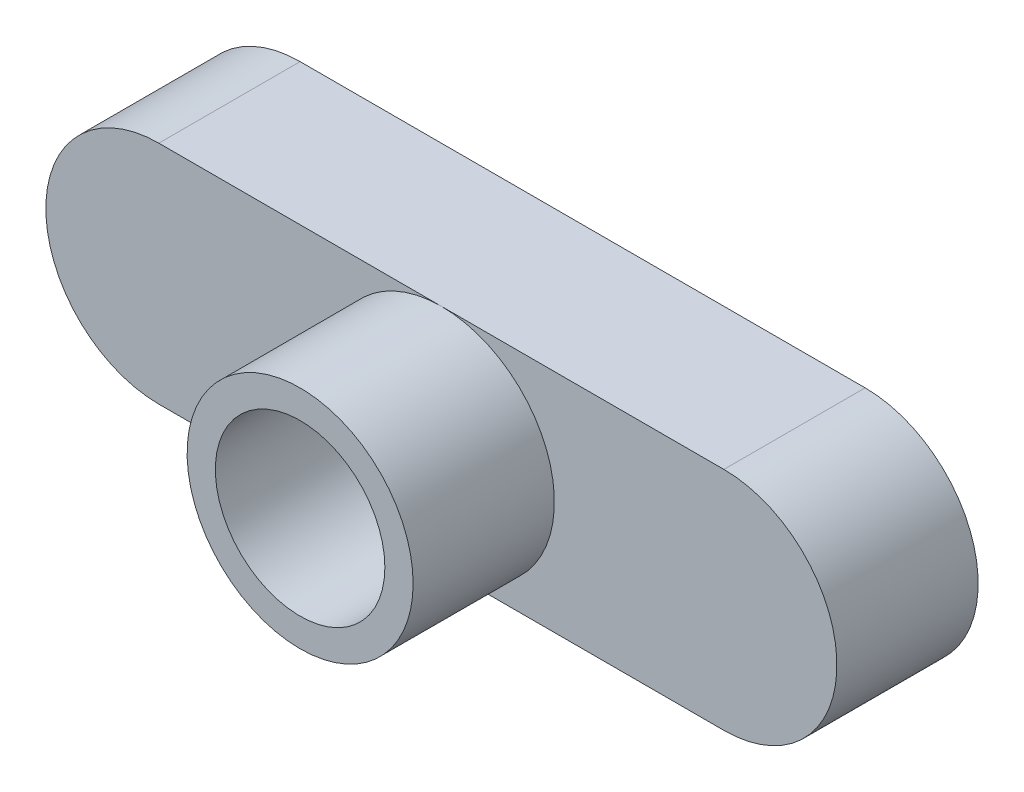
ISO-10303-21;
HEADER;
FILE_DESCRIPTION(('STEP AP214'),'2;1');
FILE_NAME('part.step','',(''),(''),'','','');
FILE_SCHEMA(('AUTOMOTIVE_DESIGN { 1 0 10303 214 1 1 1 1 }'));
ENDSEC;
DATA;
#1=APPLICATION_CONTEXT('core data for automotive mechanical design processes');
#2=APPLICATION_PROTOCOL_DEFINITION('international standard','automotive_design',2000,#1);
#3=PRODUCT_CONTEXT('',#1,'mechanical');
#4=PRODUCT('Part','Part','',(#3));
#5=PRODUCT_RELATED_PRODUCT_CATEGORY('part','',(#4));
#6=PRODUCT_DEFINITION_FORMATION('','',#4);
#7=PRODUCT_DEFINITION_CONTEXT('part definition',#1,'design');
#8=PRODUCT_DEFINITION('design','',#6,#7);
#9=PRODUCT_DEFINITION_SHAPE('','',#8);
#10=(LENGTH_UNIT() NAMED_UNIT(*) SI_UNIT(.MILLI.,.METRE.));
#11=(NAMED_UNIT(*) PLANE_ANGLE_UNIT() SI_UNIT($,.RADIAN.));
#12=(NAMED_UNIT(*) SI_UNIT($,.STERADIAN.) SOLID_ANGLE_UNIT());
#13=UNCERTAINTY_MEASURE_WITH_UNIT(LENGTH_MEASURE(1.E-05),#10,'distance_accuracy_value','');
#14=(GEOMETRIC_REPRESENTATION_CONTEXT(3) GLOBAL_UNCERTAINTY_ASSIGNED_CONTEXT((#13)) GLOBAL_UNIT_ASSIGNED_CONTEXT((#10,
#11,#12)) REPRESENTATION_CONTEXT('',''));
#15=CARTESIAN_POINT('',(0.,0.,0.));
#16=DIRECTION('',(0.,0.,1.));
#17=DIRECTION('',(1.,0.,0.));
#18=AXIS2_PLACEMENT_3D('',#15,#16,#17);
#19=CARTESIAN_POINT('',(10.,0.,5.));
#20=DIRECTION('',(0.,0.,1.));
#21=DIRECTION('',(1.,0.,0.));
#22=AXIS2_PLACEMENT_3D('',#19,#20,#21);
#23=PLANE('',#22);
#24=CARTESIAN_POINT('',(0.,0.,5.));
#25=DIRECTION('',(0.,0.,1.));
#26=DIRECTION('',(1.,0.,0.));
#27=AXIS2_PLACEMENT_3D('',#24,#25,#26);
#28=CIRCLE('',#27,4.);
#29=CARTESIAN_POINT('',(0.,4.,5.));
#30=VERTEX_POINT('',#29);
#31=CARTESIAN_POINT('',(0.,-4.,5.));
#32=VERTEX_POINT('',#31);
#33=EDGE_CURVE('E50',#30,#32,#28,.T.);
#34=ORIENTED_EDGE('',*,*,#33,.F.);
#35=DIRECTION('',(-1.,0.,0.));
#36=VECTOR('',#35,1.);
#37=CARTESIAN_POINT('',(-10.,4.,5.));
#38=LINE('',#37,#36);
#39=CARTESIAN_POINT('',(-10.,4.,5.));
#40=VERTEX_POINT('',#39);
#41=EDGE_CURVE('E98',#30,#40,#38,.T.);
#42=ORIENTED_EDGE('',*,*,#41,.T.);
#43=CARTESIAN_POINT('',(-10.,0.,5.));
#44=DIRECTION('',(0.,0.,1.));
#45=DIRECTION('',(1.,0.,0.));
#46=AXIS2_PLACEMENT_3D('',#43,#44,#45);
#47=CIRCLE('',#46,4.);
#48=CARTESIAN_POINT('',(-10.,-4.,5.));
#49=VERTEX_POINT('',#48);
#50=EDGE_CURVE('E97',#40,#49,#47,.T.);
#51=ORIENTED_EDGE('',*,*,#50,.T.);
#52=DIRECTION('',(1.,0.,0.));
#53=VECTOR('',#52,1.);
#54=CARTESIAN_POINT('',(10.,-4.,5.));
#55=LINE('',#54,#53);
#56=EDGE_CURVE('E111',#49,#32,#55,.T.);
#57=ORIENTED_EDGE('',*,*,#56,.T.);
#58=EDGE_LOOP('',(#34,#42,#51,#57));
#59=FACE_BOUND('',#58,.T.);
#60=ADVANCED_FACE('F39',(#59),#23,.T.);
#61=EDGE_CURVE('E11',#32,#30,#28,.T.);
#62=ORIENTED_EDGE('',*,*,#61,.F.);
#63=CARTESIAN_POINT('',(10.,-4.,5.));
#64=VERTEX_POINT('',#63);
#65=EDGE_CURVE('E60',#32,#64,#55,.T.);
#66=ORIENTED_EDGE('',*,*,#65,.T.);
#67=CARTESIAN_POINT('',(10.,0.,5.));
#68=DIRECTION('',(0.,0.,1.));
#69=DIRECTION('',(1.,0.,0.));
#70=AXIS2_PLACEMENT_3D('',#67,#68,#69);
#71=CIRCLE('',#70,4.);
#72=CARTESIAN_POINT('',(10.,4.,5.));
#73=VERTEX_POINT('',#72);
#74=EDGE_CURVE('E94',#64,#73,#71,.T.);
#75=ORIENTED_EDGE('',*,*,#74,.T.);
#76=EDGE_CURVE('E89',#73,#30,#38,.T.);
#77=ORIENTED_EDGE('',*,*,#76,.T.);
#78=EDGE_LOOP('',(#62,#66,#75,#77));
#79=FACE_BOUND('',#78,.T.);
#80=ADVANCED_FACE('F92',(#79),#23,.T.);
#81=CARTESIAN_POINT('',(10.,0.,0.));
#82=DIRECTION('',(0.,0.,1.));
#83=DIRECTION('',(1.,0.,0.));
#84=AXIS2_PLACEMENT_3D('',#81,#82,#83);
#85=PLANE('',#84);
#86=CARTESIAN_POINT('',(10.,0.,0.));
#87=DIRECTION('',(0.,0.,1.));
#88=DIRECTION('',(1.,0.,0.));
#89=AXIS2_PLACEMENT_3D('',#86,#87,#88);
#90=CIRCLE('',#89,4.);
#91=CARTESIAN_POINT('',(10.,-4.,0.));
#92=VERTEX_POINT('',#91);
#93=CARTESIAN_POINT('',(10.,4.,0.));
#94=VERTEX_POINT('',#93);
#95=EDGE_CURVE('E154',#92,#94,#90,.T.);
#96=ORIENTED_EDGE('',*,*,#95,.F.);
#97=DIRECTION('',(1.,0.,0.));
#98=VECTOR('',#97,1.);
#99=CARTESIAN_POINT('',(10.,-4.,0.));
#100=LINE('',#99,#98);
#101=CARTESIAN_POINT('',(-10.,-4.,0.));
#102=VERTEX_POINT('',#101);
#103=EDGE_CURVE('E82',#102,#92,#100,.T.);
#104=ORIENTED_EDGE('',*,*,#103,.F.);
#105=CARTESIAN_POINT('',(-10.,0.,0.));
#106=DIRECTION('',(0.,0.,1.));
#107=DIRECTION('',(1.,0.,0.));
#108=AXIS2_PLACEMENT_3D('',#105,#106,#107);
#109=CIRCLE('',#108,4.);
#110=CARTESIAN_POINT('',(-10.,4.,0.));
#111=VERTEX_POINT('',#110);
#112=EDGE_CURVE('E162',#111,#102,#109,.T.);
#113=ORIENTED_EDGE('',*,*,#112,.F.);
#114=DIRECTION('',(-1.,0.,0.));
#115=VECTOR('',#114,1.);
#116=CARTESIAN_POINT('',(-10.,4.,0.));
#117=LINE('',#116,#115);
#118=EDGE_CURVE('E157',#94,#111,#117,.T.);
#119=ORIENTED_EDGE('',*,*,#118,.F.);
#120=EDGE_LOOP('',(#96,#104,#113,#119));
#121=FACE_BOUND('',#120,.T.);
#122=CARTESIAN_POINT('',(0.,0.,0.));
#123=DIRECTION('',(0.,0.,1.));
#124=DIRECTION('',(1.,0.,0.));
#125=AXIS2_PLACEMENT_3D('',#122,#123,#124);
#126=CIRCLE('',#125,3.);
#127=CARTESIAN_POINT('',(3.,0.,0.));
#128=VERTEX_POINT('',#127);
#129=EDGE_CURVE('E158',#128,#128,#126,.T.);
#130=ORIENTED_EDGE('',*,*,#129,.T.);
#131=EDGE_LOOP('',(#130));
#132=FACE_BOUND('',#131,.T.);
#133=ADVANCED_FACE('F134',(#121,#132),#85,.F.);
#134=CARTESIAN_POINT('',(10.,0.,5.));
#135=DIRECTION('',(0.,0.,-1.));
#136=DIRECTION('',(-1.,0.,0.));
#137=AXIS2_PLACEMENT_3D('',#134,#135,#136);
#138=CYLINDRICAL_SURFACE('',#137,4.);
#139=ORIENTED_EDGE('',*,*,#95,.T.);
#140=DIRECTION('',(0.,0.,-1.));
#141=VECTOR('',#140,1.);
#142=CARTESIAN_POINT('',(10.,4.,5.));
#143=LINE('',#142,#141);
#144=EDGE_CURVE('E43',#73,#94,#143,.T.);
#145=ORIENTED_EDGE('',*,*,#144,.F.);
#146=ORIENTED_EDGE('',*,*,#74,.F.);
#147=DIRECTION('',(0.,0.,-1.));
#148=VECTOR('',#147,1.);
#149=CARTESIAN_POINT('',(10.,-4.,5.));
#150=LINE('',#149,#148);
#151=EDGE_CURVE('E155',#64,#92,#150,.T.);
#152=ORIENTED_EDGE('',*,*,#151,.T.);
#153=EDGE_LOOP('',(#139,#145,#146,#152));
#154=FACE_BOUND('',#153,.T.);
#155=ADVANCED_FACE('F41',(#154),#138,.T.);
#156=CARTESIAN_POINT('',(-10.,4.,5.));
#157=DIRECTION('',(0.,-1.,0.));
#158=DIRECTION('',(1.,0.,0.));
#159=AXIS2_PLACEMENT_3D('',#156,#157,#158);
#160=PLANE('',#159);
#161=ORIENTED_EDGE('',*,*,#118,.T.);
#162=DIRECTION('',(0.,0.,-1.));
#163=VECTOR('',#162,1.);
#164=CARTESIAN_POINT('',(-10.,4.,5.));
#165=LINE('',#164,#163);
#166=EDGE_CURVE('E104',#40,#111,#165,.T.);
#167=ORIENTED_EDGE('',*,*,#166,.F.);
#168=ORIENTED_EDGE('',*,*,#41,.F.);
#169=ORIENTED_EDGE('',*,*,#76,.F.);
#170=ORIENTED_EDGE('',*,*,#144,.T.);
#171=EDGE_LOOP('',(#161,#167,#168,#169,#170));
#172=FACE_BOUND('',#171,.T.);
#173=ADVANCED_FACE('F102',(#172),#160,.F.);
#174=CARTESIAN_POINT('',(-10.,0.,5.));
#175=DIRECTION('',(0.,0.,-1.));
#176=DIRECTION('',(-1.,0.,0.));
#177=AXIS2_PLACEMENT_3D('',#174,#175,#176);
#178=CYLINDRICAL_SURFACE('',#177,4.);
#179=ORIENTED_EDGE('',*,*,#112,.T.);
#180=DIRECTION('',(0.,0.,-1.));
#181=VECTOR('',#180,1.);
#182=CARTESIAN_POINT('',(-10.,-4.,5.));
#183=LINE('',#182,#181);
#184=EDGE_CURVE('E175',#49,#102,#183,.T.);
#185=ORIENTED_EDGE('',*,*,#184,.F.);
#186=ORIENTED_EDGE('',*,*,#50,.F.);
#187=ORIENTED_EDGE('',*,*,#166,.T.);
#188=EDGE_LOOP('',(#179,#185,#186,#187));
#189=FACE_BOUND('',#188,.T.);
#190=ADVANCED_FACE('F142',(#189),#178,.T.);
#191=CARTESIAN_POINT('',(10.,-4.,5.));
#192=DIRECTION('',(0.,1.,0.));
#193=DIRECTION('',(-1.,0.,0.));
#194=AXIS2_PLACEMENT_3D('',#191,#192,#193);
#195=PLANE('',#194);
#196=ORIENTED_EDGE('',*,*,#103,.T.);
#197=ORIENTED_EDGE('',*,*,#151,.F.);
#198=ORIENTED_EDGE('',*,*,#65,.F.);
#199=ORIENTED_EDGE('',*,*,#56,.F.);
#200=ORIENTED_EDGE('',*,*,#184,.T.);
#201=EDGE_LOOP('',(#196,#197,#198,#199,#200));
#202=FACE_BOUND('',#201,.T.);
#203=ADVANCED_FACE('F139',(#202),#195,.F.);
#204=CARTESIAN_POINT('',(0.,0.,5.));
#205=DIRECTION('',(0.,0.,-1.));
#206=DIRECTION('',(-1.,0.,0.));
#207=AXIS2_PLACEMENT_3D('',#204,#205,#206);
#208=CYLINDRICAL_SURFACE('',#207,3.);
#209=ORIENTED_EDGE('',*,*,#129,.F.);
#210=EDGE_LOOP('',(#209));
#211=FACE_BOUND('',#210,.T.);
#212=CARTESIAN_POINT('',(0.,0.,10.));
#213=DIRECTION('',(0.,0.,1.));
#214=DIRECTION('',(1.,0.,0.));
#215=AXIS2_PLACEMENT_3D('',#212,#213,#214);
#216=CIRCLE('',#215,3.);
#217=CARTESIAN_POINT('',(3.,0.,10.));
#218=VERTEX_POINT('',#217);
#219=EDGE_CURVE('E115',#218,#218,#216,.T.);
#220=ORIENTED_EDGE('',*,*,#219,.T.);
#221=EDGE_LOOP('',(#220));
#222=FACE_BOUND('',#221,.T.);
#223=ADVANCED_FACE('F124',(#211,#222),#208,.F.);
#224=CARTESIAN_POINT('',(0.,0.,10.));
#225=DIRECTION('',(0.,0.,1.));
#226=DIRECTION('',(1.,0.,0.));
#227=AXIS2_PLACEMENT_3D('',#224,#225,#226);
#228=PLANE('',#227);
#229=CARTESIAN_POINT('',(0.,0.,10.));
#230=DIRECTION('',(0.,0.,1.));
#231=DIRECTION('',(1.,0.,0.));
#232=AXIS2_PLACEMENT_3D('',#229,#230,#231);
#233=CIRCLE('',#232,4.);
#234=CARTESIAN_POINT('',(4.,0.,10.));
#235=VERTEX_POINT('',#234);
#236=EDGE_CURVE('E114',#235,#235,#233,.T.);
#237=ORIENTED_EDGE('',*,*,#236,.T.);
#238=EDGE_LOOP('',(#237));
#239=FACE_BOUND('',#238,.T.);
#240=ORIENTED_EDGE('',*,*,#219,.F.);
#241=EDGE_LOOP('',(#240));
#242=FACE_BOUND('',#241,.T.);
#243=ADVANCED_FACE('F118',(#239,#242),#228,.T.);
#244=CARTESIAN_POINT('',(0.,0.,10.));
#245=DIRECTION('',(0.,0.,-1.));
#246=DIRECTION('',(-1.,0.,0.));
#247=AXIS2_PLACEMENT_3D('',#244,#245,#246);
#248=CYLINDRICAL_SURFACE('',#247,4.);
#249=ORIENTED_EDGE('',*,*,#236,.F.);
#250=EDGE_LOOP('',(#249));
#251=FACE_BOUND('',#250,.T.);
#252=ORIENTED_EDGE('',*,*,#33,.T.);
#253=ORIENTED_EDGE('',*,*,#61,.T.);
#254=EDGE_LOOP('',(#252,#253));
#255=FACE_BOUND('',#254,.T.);
#256=ADVANCED_FACE('F116',(#251,#255),#248,.T.);
#257=CLOSED_SHELL('',(#60,#80,#133,#155,#173,#190,#203,#223,#243,#256));
#258=MANIFOLD_SOLID_BREP('B2',#257);
#259=ADVANCED_BREP_SHAPE_REPRESENTATION('',(#18,#258),#14);
#260=SHAPE_DEFINITION_REPRESENTATION(#9,#259);
ENDSEC;
END-ISO-10303-21;
